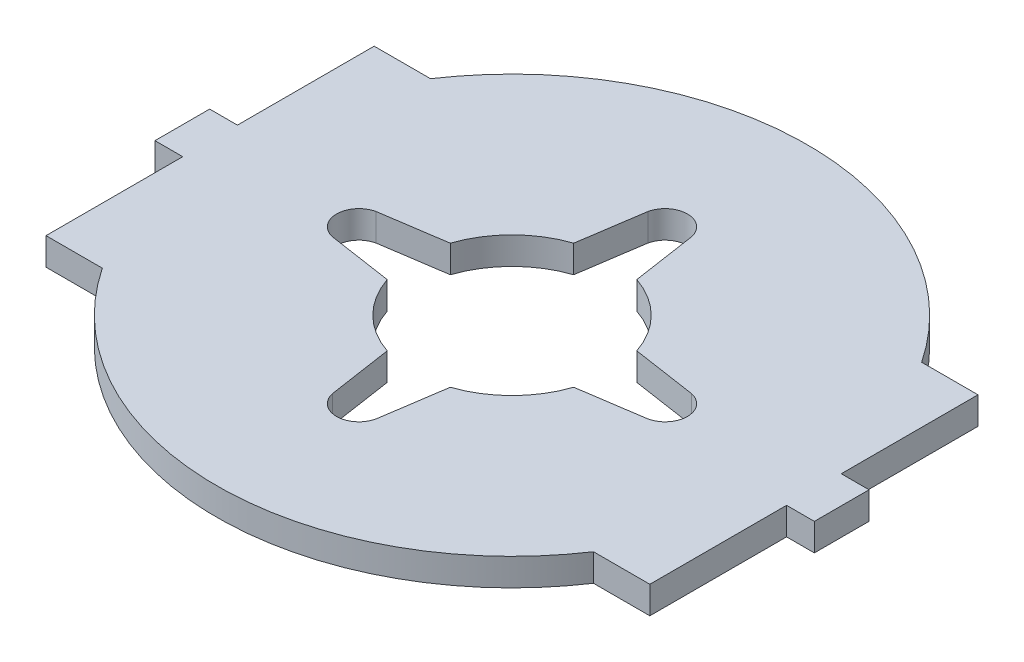
ISO-10303-21;
HEADER;
FILE_DESCRIPTION(('STEP AP214'),'2;1');
FILE_NAME('part.step','',(''),(''),'','','');
FILE_SCHEMA(('AUTOMOTIVE_DESIGN { 1 0 10303 214 1 1 1 1 }'));
ENDSEC;
DATA;
#1=APPLICATION_CONTEXT('core data for automotive mechanical design processes');
#2=APPLICATION_PROTOCOL_DEFINITION('international standard','automotive_design',2000,#1);
#3=PRODUCT_CONTEXT('',#1,'mechanical');
#4=PRODUCT('Part','Part','',(#3));
#5=PRODUCT_RELATED_PRODUCT_CATEGORY('part','',(#4));
#6=PRODUCT_DEFINITION_FORMATION('','',#4);
#7=PRODUCT_DEFINITION_CONTEXT('part definition',#1,'design');
#8=PRODUCT_DEFINITION('design','',#6,#7);
#9=PRODUCT_DEFINITION_SHAPE('','',#8);
#10=(LENGTH_UNIT() NAMED_UNIT(*) SI_UNIT(.MILLI.,.METRE.));
#11=(NAMED_UNIT(*) PLANE_ANGLE_UNIT() SI_UNIT($,.RADIAN.));
#12=(NAMED_UNIT(*) SI_UNIT($,.STERADIAN.) SOLID_ANGLE_UNIT());
#13=UNCERTAINTY_MEASURE_WITH_UNIT(LENGTH_MEASURE(1.E-05),#10,'distance_accuracy_value','');
#14=(GEOMETRIC_REPRESENTATION_CONTEXT(3) GLOBAL_UNCERTAINTY_ASSIGNED_CONTEXT((#13)) GLOBAL_UNIT_ASSIGNED_CONTEXT((#10,
#11,#12)) REPRESENTATION_CONTEXT('',''));
#15=CARTESIAN_POINT('',(0.,0.,0.));
#16=DIRECTION('',(0.,0.,1.));
#17=DIRECTION('',(1.,0.,0.));
#18=AXIS2_PLACEMENT_3D('',#15,#16,#17);
#19=CARTESIAN_POINT('',(35.052,3.175,19.05));
#20=DIRECTION('',(-1.,0.,0.));
#21=DIRECTION('',(0.,0.,1.));
#22=AXIS2_PLACEMENT_3D('',#19,#20,#21);
#23=PLANE('',#22);
#24=DIRECTION('',(0.,1.,0.));
#25=VECTOR('',#24,1.);
#26=CARTESIAN_POINT('',(35.052,0.,-3.175));
#27=LINE('',#26,#25);
#28=CARTESIAN_POINT('',(35.052,0.,-3.175));
#29=VERTEX_POINT('',#28);
#30=CARTESIAN_POINT('',(35.052,3.175,-3.175));
#31=VERTEX_POINT('',#30);
#32=EDGE_CURVE('E308',#29,#31,#27,.T.);
#33=ORIENTED_EDGE('',*,*,#32,.F.);
#34=DIRECTION('',(0.,0.,-1.));
#35=VECTOR('',#34,1.);
#36=CARTESIAN_POINT('',(35.052,0.,19.05));
#37=LINE('',#36,#35);
#38=CARTESIAN_POINT('',(35.052,0.,-19.05));
#39=VERTEX_POINT('',#38);
#40=EDGE_CURVE('E449',#29,#39,#37,.T.);
#41=ORIENTED_EDGE('',*,*,#40,.T.);
#42=DIRECTION('',(0.,-1.,0.));
#43=VECTOR('',#42,1.);
#44=CARTESIAN_POINT('',(35.052,3.175,-19.05));
#45=LINE('',#44,#43);
#46=CARTESIAN_POINT('',(35.052,3.175,-19.05));
#47=VERTEX_POINT('',#46);
#48=EDGE_CURVE('E325',#47,#39,#45,.T.);
#49=ORIENTED_EDGE('',*,*,#48,.F.);
#50=DIRECTION('',(0.,0.,-1.));
#51=VECTOR('',#50,1.);
#52=CARTESIAN_POINT('',(35.052,3.175,19.05));
#53=LINE('',#52,#51);
#54=EDGE_CURVE('E456',#31,#47,#53,.T.);
#55=ORIENTED_EDGE('',*,*,#54,.F.);
#56=EDGE_LOOP('',(#33,#41,#49,#55));
#57=FACE_BOUND('',#56,.T.);
#58=ADVANCED_FACE('F32',(#57),#23,.F.);
#59=CARTESIAN_POINT('',(-35.052,3.175,19.05));
#60=DIRECTION('',(1.,0.,0.));
#61=DIRECTION('',(0.,0.,-1.));
#62=AXIS2_PLACEMENT_3D('',#59,#60,#61);
#63=PLANE('',#62);
#64=DIRECTION('',(0.,1.,0.));
#65=VECTOR('',#64,1.);
#66=CARTESIAN_POINT('',(-35.052,0.,3.175));
#67=LINE('',#66,#65);
#68=CARTESIAN_POINT('',(-35.052,0.,3.175));
#69=VERTEX_POINT('',#68);
#70=CARTESIAN_POINT('',(-35.052,3.175,3.175));
#71=VERTEX_POINT('',#70);
#72=EDGE_CURVE('E416',#69,#71,#67,.T.);
#73=ORIENTED_EDGE('',*,*,#72,.F.);
#74=DIRECTION('',(0.,0.,1.));
#75=VECTOR('',#74,1.);
#76=CARTESIAN_POINT('',(-35.052,0.,19.05));
#77=LINE('',#76,#75);
#78=CARTESIAN_POINT('',(-35.052,0.,19.05));
#79=VERTEX_POINT('',#78);
#80=EDGE_CURVE('E475',#69,#79,#77,.T.);
#81=ORIENTED_EDGE('',*,*,#80,.T.);
#82=DIRECTION('',(0.,-1.,0.));
#83=VECTOR('',#82,1.);
#84=CARTESIAN_POINT('',(-35.052,3.175,19.05));
#85=LINE('',#84,#83);
#86=CARTESIAN_POINT('',(-35.052,3.175,19.05));
#87=VERTEX_POINT('',#86);
#88=EDGE_CURVE('E494',#87,#79,#85,.T.);
#89=ORIENTED_EDGE('',*,*,#88,.F.);
#90=DIRECTION('',(0.,0.,1.));
#91=VECTOR('',#90,1.);
#92=CARTESIAN_POINT('',(-35.052,3.175,19.05));
#93=LINE('',#92,#91);
#94=EDGE_CURVE('E509',#71,#87,#93,.T.);
#95=ORIENTED_EDGE('',*,*,#94,.F.);
#96=EDGE_LOOP('',(#73,#81,#89,#95));
#97=FACE_BOUND('',#96,.T.);
#98=ADVANCED_FACE('F548',(#97),#63,.F.);
#99=CARTESIAN_POINT('',(-35.052,3.175,-19.05));
#100=DIRECTION('',(0.,0.,1.));
#101=DIRECTION('',(1.,0.,0.));
#102=AXIS2_PLACEMENT_3D('',#99,#100,#101);
#103=PLANE('',#102);
#104=DIRECTION('',(-1.,0.,0.));
#105=VECTOR('',#104,1.);
#106=CARTESIAN_POINT('',(-35.052,0.,-19.05));
#107=LINE('',#106,#105);
#108=CARTESIAN_POINT('',(28.5114292872174,0.,-19.05));
#109=VERTEX_POINT('',#108);
#110=EDGE_CURVE('E471',#39,#109,#107,.T.);
#111=ORIENTED_EDGE('',*,*,#110,.T.);
#112=DIRECTION('',(0.,1.,0.));
#113=VECTOR('',#112,1.);
#114=CARTESIAN_POINT('',(28.5114292872174,0.,-19.05));
#115=LINE('',#114,#113);
#116=CARTESIAN_POINT('',(28.5114292872174,3.175,-19.05));
#117=VERTEX_POINT('',#116);
#118=EDGE_CURVE('E446',#109,#117,#115,.T.);
#119=ORIENTED_EDGE('',*,*,#118,.T.);
#120=DIRECTION('',(-1.,0.,0.));
#121=VECTOR('',#120,1.);
#122=CARTESIAN_POINT('',(-35.052,3.175,-19.05));
#123=LINE('',#122,#121);
#124=EDGE_CURVE('E452',#47,#117,#123,.T.);
#125=ORIENTED_EDGE('',*,*,#124,.F.);
#126=ORIENTED_EDGE('',*,*,#48,.T.);
#127=EDGE_LOOP('',(#111,#119,#125,#126));
#128=FACE_BOUND('',#127,.T.);
#129=ADVANCED_FACE('F553',(#128),#103,.F.);
#130=CARTESIAN_POINT('',(-35.052,3.175,19.05));
#131=DIRECTION('',(0.,0.,-1.));
#132=DIRECTION('',(-1.,0.,0.));
#133=AXIS2_PLACEMENT_3D('',#130,#131,#132);
#134=PLANE('',#133);
#135=DIRECTION('',(1.,0.,0.));
#136=VECTOR('',#135,1.);
#137=CARTESIAN_POINT('',(-35.052,0.,19.05));
#138=LINE('',#137,#136);
#139=CARTESIAN_POINT('',(-28.5114292872174,0.,19.05));
#140=VERTEX_POINT('',#139);
#141=EDGE_CURVE('E479',#79,#140,#138,.T.);
#142=ORIENTED_EDGE('',*,*,#141,.T.);
#143=DIRECTION('',(0.,1.,0.));
#144=VECTOR('',#143,1.);
#145=CARTESIAN_POINT('',(-28.5114292872174,0.,19.05));
#146=LINE('',#145,#144);
#147=CARTESIAN_POINT('',(-28.5114292872174,3.175,19.05));
#148=VERTEX_POINT('',#147);
#149=EDGE_CURVE('E440',#140,#148,#146,.T.);
#150=ORIENTED_EDGE('',*,*,#149,.T.);
#151=DIRECTION('',(1.,0.,0.));
#152=VECTOR('',#151,1.);
#153=CARTESIAN_POINT('',(-35.052,3.175,19.05));
#154=LINE('',#153,#152);
#155=EDGE_CURVE('E470',#87,#148,#154,.T.);
#156=ORIENTED_EDGE('',*,*,#155,.F.);
#157=ORIENTED_EDGE('',*,*,#88,.T.);
#158=EDGE_LOOP('',(#142,#150,#156,#157));
#159=FACE_BOUND('',#158,.T.);
#160=ADVANCED_FACE('F560',(#159),#134,.F.);
#161=CARTESIAN_POINT('',(35.052,0.,19.05));
#162=VERTEX_POINT('',#161);
#163=CARTESIAN_POINT('',(35.052,0.,3.175));
#164=VERTEX_POINT('',#163);
#165=EDGE_CURVE('E465',#162,#164,#37,.T.);
#166=ORIENTED_EDGE('',*,*,#165,.T.);
#167=DIRECTION('',(0.,1.,0.));
#168=VECTOR('',#167,1.);
#169=CARTESIAN_POINT('',(35.052,0.,3.175));
#170=LINE('',#169,#168);
#171=CARTESIAN_POINT('',(35.052,3.175,3.17500000000001));
#172=VERTEX_POINT('',#171);
#173=EDGE_CURVE('E315',#164,#172,#170,.T.);
#174=ORIENTED_EDGE('',*,*,#173,.T.);
#175=CARTESIAN_POINT('',(35.052,3.175,19.05));
#176=VERTEX_POINT('',#175);
#177=EDGE_CURVE('E459',#176,#172,#53,.T.);
#178=ORIENTED_EDGE('',*,*,#177,.F.);
#179=DIRECTION('',(0.,-1.,0.));
#180=VECTOR('',#179,1.);
#181=CARTESIAN_POINT('',(35.052,3.175,19.05));
#182=LINE('',#181,#180);
#183=EDGE_CURVE('E496',#176,#162,#182,.T.);
#184=ORIENTED_EDGE('',*,*,#183,.T.);
#185=EDGE_LOOP('',(#166,#174,#178,#184));
#186=FACE_BOUND('',#185,.T.);
#187=ADVANCED_FACE('F34',(#186),#23,.F.);
#188=CARTESIAN_POINT('',(-28.5114292872174,3.175,-19.05));
#189=VERTEX_POINT('',#188);
#190=CARTESIAN_POINT('',(-35.052,3.175,-19.05));
#191=VERTEX_POINT('',#190);
#192=EDGE_CURVE('E462',#189,#191,#123,.T.);
#193=ORIENTED_EDGE('',*,*,#192,.F.);
#194=DIRECTION('',(0.,1.,0.));
#195=VECTOR('',#194,1.);
#196=CARTESIAN_POINT('',(-28.5114292872174,0.,-19.05));
#197=LINE('',#196,#195);
#198=CARTESIAN_POINT('',(-28.5114292872174,0.,-19.05));
#199=VERTEX_POINT('',#198);
#200=EDGE_CURVE('E443',#189,#199,#197,.F.);
#201=ORIENTED_EDGE('',*,*,#200,.T.);
#202=CARTESIAN_POINT('',(-35.052,0.,-19.05));
#203=VERTEX_POINT('',#202);
#204=EDGE_CURVE('E476',#199,#203,#107,.T.);
#205=ORIENTED_EDGE('',*,*,#204,.T.);
#206=DIRECTION('',(0.,-1.,0.));
#207=VECTOR('',#206,1.);
#208=CARTESIAN_POINT('',(-35.052,3.175,-19.05));
#209=LINE('',#208,#207);
#210=EDGE_CURVE('E491',#191,#203,#209,.T.);
#211=ORIENTED_EDGE('',*,*,#210,.F.);
#212=EDGE_LOOP('',(#193,#201,#205,#211));
#213=FACE_BOUND('',#212,.T.);
#214=ADVANCED_FACE('F559',(#213),#103,.F.);
#215=CARTESIAN_POINT('',(-35.052,0.,-3.175));
#216=VERTEX_POINT('',#215);
#217=EDGE_CURVE('E485',#203,#216,#77,.T.);
#218=ORIENTED_EDGE('',*,*,#217,.T.);
#219=DIRECTION('',(0.,1.,0.));
#220=VECTOR('',#219,1.);
#221=CARTESIAN_POINT('',(-35.052,0.,-3.175));
#222=LINE('',#221,#220);
#223=CARTESIAN_POINT('',(-35.052,3.175,-3.17499999999999));
#224=VERTEX_POINT('',#223);
#225=EDGE_CURVE('E520',#216,#224,#222,.T.);
#226=ORIENTED_EDGE('',*,*,#225,.T.);
#227=EDGE_CURVE('E506',#191,#224,#93,.T.);
#228=ORIENTED_EDGE('',*,*,#227,.F.);
#229=ORIENTED_EDGE('',*,*,#210,.T.);
#230=EDGE_LOOP('',(#218,#226,#228,#229));
#231=FACE_BOUND('',#230,.T.);
#232=ADVANCED_FACE('F556',(#231),#63,.F.);
#233=CARTESIAN_POINT('',(28.5114292872174,3.175,19.05));
#234=VERTEX_POINT('',#233);
#235=EDGE_CURVE('E504',#234,#176,#154,.T.);
#236=ORIENTED_EDGE('',*,*,#235,.F.);
#237=DIRECTION('',(0.,1.,0.));
#238=VECTOR('',#237,1.);
#239=CARTESIAN_POINT('',(28.5114292872174,0.,19.05));
#240=LINE('',#239,#238);
#241=CARTESIAN_POINT('',(28.5114292872174,0.,19.05));
#242=VERTEX_POINT('',#241);
#243=EDGE_CURVE('E437',#234,#242,#240,.F.);
#244=ORIENTED_EDGE('',*,*,#243,.T.);
#245=EDGE_CURVE('E488',#242,#162,#138,.T.);
#246=ORIENTED_EDGE('',*,*,#245,.T.);
#247=ORIENTED_EDGE('',*,*,#183,.F.);
#248=EDGE_LOOP('',(#236,#244,#246,#247));
#249=FACE_BOUND('',#248,.T.);
#250=ADVANCED_FACE('F568',(#249),#134,.F.);
#251=CARTESIAN_POINT('',(35.052,3.175,-19.05));
#252=DIRECTION('',(0.,-1.,0.));
#253=DIRECTION('',(0.,0.,-1.));
#254=AXIS2_PLACEMENT_3D('',#251,#252,#253);
#255=PLANE('',#254);
#256=DIRECTION('',(-0.148134237309503,0.,-0.988967263228026));
#257=VECTOR('',#256,1.);
#258=CARTESIAN_POINT('',(2.54,3.175,-18.3060770000733));
#259=LINE('',#258,#257);
#260=CARTESIAN_POINT('',(3.66009636812809,3.175,-10.8281390172095));
#261=VERTEX_POINT('',#260);
#262=CARTESIAN_POINT('',(2.54,3.175,-18.3060770000733));
#263=VERTEX_POINT('',#262);
#264=EDGE_CURVE('E409',#261,#263,#259,.T.);
#265=ORIENTED_EDGE('',*,*,#264,.F.);
#266=CARTESIAN_POINT('',(0.,3.175,0.));
#267=DIRECTION('',(0.,1.,0.));
#268=DIRECTION('',(0.,0.,1.));
#269=AXIS2_PLACEMENT_3D('',#266,#267,#268);
#270=CIRCLE('',#269,11.43);
#271=CARTESIAN_POINT('',(10.8281390172095,3.175,-3.6600963681282));
#272=VERTEX_POINT('',#271);
#273=EDGE_CURVE('E261',#272,#261,#270,.T.);
#274=ORIENTED_EDGE('',*,*,#273,.F.);
#275=DIRECTION('',(-0.988967263228028,0.,-0.148134237309493));
#276=VECTOR('',#275,1.);
#277=CARTESIAN_POINT('',(18.3060770000732,3.175,-2.54000000000019));
#278=LINE('',#277,#276);
#279=CARTESIAN_POINT('',(18.3060770000732,3.175,-2.54000000000019));
#280=VERTEX_POINT('',#279);
#281=EDGE_CURVE('E383',#280,#272,#278,.T.);
#282=ORIENTED_EDGE('',*,*,#281,.F.);
#283=CARTESIAN_POINT('',(17.7701158247429,3.175,-1.86132083373512E-13));
#284=DIRECTION('',(0.,1.,0.));
#285=DIRECTION('',(1.,0.,0.));
#286=AXIS2_PLACEMENT_3D('',#283,#284,#285);
#287=CIRCLE('',#286,2.59593034988644);
#288=CARTESIAN_POINT('',(18.3060770000733,3.175,2.53999999999981));
#289=VERTEX_POINT('',#288);
#290=EDGE_CURVE('E380',#289,#280,#287,.T.);
#291=ORIENTED_EDGE('',*,*,#290,.F.);
#292=DIRECTION('',(0.988967263228025,0.,-0.148134237309514));
#293=VECTOR('',#292,1.);
#294=CARTESIAN_POINT('',(18.3060770000733,3.175,2.53999999999981));
#295=LINE('',#294,#293);
#296=CARTESIAN_POINT('',(10.8281390172096,3.175,3.66009636812797));
#297=VERTEX_POINT('',#296);
#298=EDGE_CURVE('E260',#297,#289,#295,.T.);
#299=ORIENTED_EDGE('',*,*,#298,.F.);
#300=CARTESIAN_POINT('',(3.66009636812809,3.175,10.8281390172095));
#301=VERTEX_POINT('',#300);
#302=EDGE_CURVE('E243',#301,#297,#270,.T.);
#303=ORIENTED_EDGE('',*,*,#302,.F.);
#304=DIRECTION('',(0.148134237309503,0.,-0.988967263228026));
#305=VECTOR('',#304,1.);
#306=CARTESIAN_POINT('',(2.54,3.175,18.3060770000733));
#307=LINE('',#306,#305);
#308=CARTESIAN_POINT('',(2.54,3.175,18.3060770000733));
#309=VERTEX_POINT('',#308);
#310=EDGE_CURVE('E258',#309,#301,#307,.T.);
#311=ORIENTED_EDGE('',*,*,#310,.F.);
#312=CARTESIAN_POINT('',(0.,3.175,17.7701158247429));
#313=DIRECTION('',(0.,1.,0.));
#314=DIRECTION('',(0.,0.,1.));
#315=AXIS2_PLACEMENT_3D('',#312,#313,#314);
#316=CIRCLE('',#315,2.59593034988644);
#317=CARTESIAN_POINT('',(-2.54,3.175,18.3060770000733));
#318=VERTEX_POINT('',#317);
#319=EDGE_CURVE('E268',#318,#309,#316,.T.);
#320=ORIENTED_EDGE('',*,*,#319,.F.);
#321=DIRECTION('',(0.148134237309503,0.,0.988967263228026));
#322=VECTOR('',#321,1.);
#323=CARTESIAN_POINT('',(-2.54,3.175,18.3060770000733));
#324=LINE('',#323,#322);
#325=CARTESIAN_POINT('',(-3.66009636812809,3.175,10.8281390172095));
#326=VERTEX_POINT('',#325);
#327=EDGE_CURVE('E272',#326,#318,#324,.T.);
#328=ORIENTED_EDGE('',*,*,#327,.F.);
#329=CARTESIAN_POINT('',(-10.8281390172095,3.175,3.66009636812812));
#330=VERTEX_POINT('',#329);
#331=EDGE_CURVE('E55',#330,#326,#270,.T.);
#332=ORIENTED_EDGE('',*,*,#331,.F.);
#333=DIRECTION('',(0.988967263228027,0.,0.1481342373095));
#334=VECTOR('',#333,1.);
#335=CARTESIAN_POINT('',(-18.3060770000733,3.175,2.54000000000006));
#336=LINE('',#335,#334);
#337=CARTESIAN_POINT('',(-18.3060770000733,3.175,2.54000000000006));
#338=VERTEX_POINT('',#337);
#339=EDGE_CURVE('E282',#338,#330,#336,.T.);
#340=ORIENTED_EDGE('',*,*,#339,.F.);
#341=CARTESIAN_POINT('',(-17.7701158247429,3.175,0.));
#342=DIRECTION('',(0.,1.,0.));
#343=DIRECTION('',(-1.,0.,0.));
#344=AXIS2_PLACEMENT_3D('',#341,#342,#343);
#345=CIRCLE('',#344,2.59593034988644);
#346=CARTESIAN_POINT('',(-18.3060770000733,3.175,-2.53999999999994));
#347=VERTEX_POINT('',#346);
#348=EDGE_CURVE('E279',#347,#338,#345,.T.);
#349=ORIENTED_EDGE('',*,*,#348,.F.);
#350=DIRECTION('',(-0.988967263228026,0.,0.148134237309507));
#351=VECTOR('',#350,1.);
#352=CARTESIAN_POINT('',(-18.3060770000733,3.175,-2.53999999999994));
#353=LINE('',#352,#351);
#354=CARTESIAN_POINT('',(-10.8281390172095,3.175,-3.66009636812805));
#355=VERTEX_POINT('',#354);
#356=EDGE_CURVE('E276',#355,#347,#353,.T.);
#357=ORIENTED_EDGE('',*,*,#356,.F.);
#358=CARTESIAN_POINT('',(-3.66009636812809,3.175,-10.8281390172095));
#359=VERTEX_POINT('',#358);
#360=EDGE_CURVE('E47',#359,#355,#270,.T.);
#361=ORIENTED_EDGE('',*,*,#360,.F.);
#362=DIRECTION('',(-0.148134237309503,0.,0.988967263228026));
#363=VECTOR('',#362,1.);
#364=CARTESIAN_POINT('',(-2.54,3.175,-18.3060770000733));
#365=LINE('',#364,#363);
#366=CARTESIAN_POINT('',(-2.54,3.175,-18.3060770000733));
#367=VERTEX_POINT('',#366);
#368=EDGE_CURVE('E418',#367,#359,#365,.T.);
#369=ORIENTED_EDGE('',*,*,#368,.F.);
#370=CARTESIAN_POINT('',(0.,3.175,-17.7701158247429));
#371=DIRECTION('',(0.,1.,0.));
#372=DIRECTION('',(0.,0.,-1.));
#373=AXIS2_PLACEMENT_3D('',#370,#371,#372);
#374=CIRCLE('',#373,2.59593034988644);
#375=EDGE_CURVE('E415',#263,#367,#374,.T.);
#376=ORIENTED_EDGE('',*,*,#375,.F.);
#377=EDGE_LOOP('',(#265,#274,#282,#291,#299,#303,#311,#320,#328,#332,#340,#349,#357,#361,#369,#376));
#378=FACE_BOUND('',#377,.T.);
#379=ORIENTED_EDGE('',*,*,#155,.T.);
#380=CARTESIAN_POINT('',(0.,3.175,0.));
#381=DIRECTION('',(0.,1.,0.));
#382=DIRECTION('',(0.,0.,1.));
#383=AXIS2_PLACEMENT_3D('',#380,#381,#382);
#384=CIRCLE('',#383,34.29);
#385=EDGE_CURVE('E429',#148,#234,#384,.T.);
#386=ORIENTED_EDGE('',*,*,#385,.T.);
#387=ORIENTED_EDGE('',*,*,#235,.T.);
#388=ORIENTED_EDGE('',*,*,#177,.T.);
#389=DIRECTION('',(-1.,0.,0.));
#390=VECTOR('',#389,1.);
#391=CARTESIAN_POINT('',(38.2778,3.175,3.175));
#392=LINE('',#391,#390);
#393=CARTESIAN_POINT('',(38.2778,3.175,3.175));
#394=VERTEX_POINT('',#393);
#395=EDGE_CURVE('E295',#394,#172,#392,.T.);
#396=ORIENTED_EDGE('',*,*,#395,.F.);
#397=DIRECTION('',(0.,0.,1.));
#398=VECTOR('',#397,1.);
#399=CARTESIAN_POINT('',(38.2778,3.175,-3.175));
#400=LINE('',#399,#398);
#401=CARTESIAN_POINT('',(38.2778,3.175,-3.175));
#402=VERTEX_POINT('',#401);
#403=EDGE_CURVE('E300',#402,#394,#400,.T.);
#404=ORIENTED_EDGE('',*,*,#403,.F.);
#405=DIRECTION('',(1.,0.,0.));
#406=VECTOR('',#405,1.);
#407=CARTESIAN_POINT('',(35.052,3.175,-3.175));
#408=LINE('',#407,#406);
#409=EDGE_CURVE('E302',#31,#402,#408,.T.);
#410=ORIENTED_EDGE('',*,*,#409,.F.);
#411=ORIENTED_EDGE('',*,*,#54,.T.);
#412=ORIENTED_EDGE('',*,*,#124,.T.);
#413=EDGE_CURVE('E435',#117,#189,#384,.T.);
#414=ORIENTED_EDGE('',*,*,#413,.T.);
#415=ORIENTED_EDGE('',*,*,#192,.T.);
#416=ORIENTED_EDGE('',*,*,#227,.T.);
#417=DIRECTION('',(-1.,0.,0.));
#418=VECTOR('',#417,1.);
#419=CARTESIAN_POINT('',(-35.052,3.175,-3.175));
#420=LINE('',#419,#418);
#421=CARTESIAN_POINT('',(-38.2778,3.175,-3.175));
#422=VERTEX_POINT('',#421);
#423=EDGE_CURVE('E311',#224,#422,#420,.T.);
#424=ORIENTED_EDGE('',*,*,#423,.T.);
#425=DIRECTION('',(0.,0.,1.));
#426=VECTOR('',#425,1.);
#427=CARTESIAN_POINT('',(-38.2778,3.175,-3.175));
#428=LINE('',#427,#426);
#429=CARTESIAN_POINT('',(-38.2778,3.175,3.175));
#430=VERTEX_POINT('',#429);
#431=EDGE_CURVE('E517',#422,#430,#428,.T.);
#432=ORIENTED_EDGE('',*,*,#431,.T.);
#433=DIRECTION('',(1.,0.,0.));
#434=VECTOR('',#433,1.);
#435=CARTESIAN_POINT('',(-38.2778,3.175,3.175));
#436=LINE('',#435,#434);
#437=EDGE_CURVE('E586',#430,#71,#436,.T.);
#438=ORIENTED_EDGE('',*,*,#437,.T.);
#439=ORIENTED_EDGE('',*,*,#94,.T.);
#440=EDGE_LOOP('',(#379,#386,#387,#388,#396,#404,#410,#411,#412,#414,#415,#416,#424,#432,#438,#439));
#441=FACE_BOUND('',#440,.T.);
#442=ADVANCED_FACE('F255',(#378,#441),#255,.F.);
#443=CARTESIAN_POINT('',(35.052,0.,-19.05));
#444=DIRECTION('',(0.,-1.,0.));
#445=DIRECTION('',(0.,0.,-1.));
#446=AXIS2_PLACEMENT_3D('',#443,#444,#445);
#447=PLANE('',#446);
#448=CARTESIAN_POINT('',(0.,0.,0.));
#449=DIRECTION('',(0.,-1.,0.));
#450=DIRECTION('',(0.,0.,-1.));
#451=AXIS2_PLACEMENT_3D('',#448,#449,#450);
#452=CIRCLE('',#451,11.43);
#453=CARTESIAN_POINT('',(3.66009636812809,0.,-10.8281390172095));
#454=VERTEX_POINT('',#453);
#455=CARTESIAN_POINT('',(10.8281390172095,0.,-3.6600963681282));
#456=VERTEX_POINT('',#455);
#457=EDGE_CURVE('E365',#454,#456,#452,.T.);
#458=ORIENTED_EDGE('',*,*,#457,.F.);
#459=DIRECTION('',(-0.148134237309503,0.,-0.988967263228026));
#460=VECTOR('',#459,1.);
#461=CARTESIAN_POINT('',(2.54,0.,-18.3060770000733));
#462=LINE('',#461,#460);
#463=CARTESIAN_POINT('',(2.54,0.,-18.3060770000733));
#464=VERTEX_POINT('',#463);
#465=EDGE_CURVE('E411',#454,#464,#462,.T.);
#466=ORIENTED_EDGE('',*,*,#465,.T.);
#467=CARTESIAN_POINT('',(0.,0.,-17.7701158247429));
#468=DIRECTION('',(0.,1.,0.));
#469=DIRECTION('',(0.,0.,-1.));
#470=AXIS2_PLACEMENT_3D('',#467,#468,#469);
#471=CIRCLE('',#470,2.59593034988644);
#472=CARTESIAN_POINT('',(-2.54,0.,-18.3060770000733));
#473=VERTEX_POINT('',#472);
#474=EDGE_CURVE('E532',#464,#473,#471,.T.);
#475=ORIENTED_EDGE('',*,*,#474,.T.);
#476=DIRECTION('',(-0.148134237309503,0.,0.988967263228026));
#477=VECTOR('',#476,1.);
#478=CARTESIAN_POINT('',(-2.54,0.,-18.3060770000733));
#479=LINE('',#478,#477);
#480=CARTESIAN_POINT('',(-3.66009636812809,0.,-10.8281390172095));
#481=VERTEX_POINT('',#480);
#482=EDGE_CURVE('E355',#473,#481,#479,.T.);
#483=ORIENTED_EDGE('',*,*,#482,.T.);
#484=CARTESIAN_POINT('',(-10.8281390172096,0.,-3.66009636812805));
#485=VERTEX_POINT('',#484);
#486=EDGE_CURVE('E352',#485,#481,#452,.T.);
#487=ORIENTED_EDGE('',*,*,#486,.F.);
#488=DIRECTION('',(0.988967263228026,0.,-0.148134237309507));
#489=VECTOR('',#488,1.);
#490=CARTESIAN_POINT('',(36.2998371120074,0.,-10.7192448955071));
#491=LINE('',#490,#489);
#492=CARTESIAN_POINT('',(-18.3060770000733,0.,-2.53999999999994));
#493=VERTEX_POINT('',#492);
#494=EDGE_CURVE('E292',#493,#485,#491,.T.);
#495=ORIENTED_EDGE('',*,*,#494,.F.);
#496=CARTESIAN_POINT('',(-17.7701158247429,0.,0.));
#497=DIRECTION('',(0.,-1.,0.));
#498=DIRECTION('',(0.,0.,-1.));
#499=AXIS2_PLACEMENT_3D('',#496,#497,#498);
#500=CIRCLE('',#499,2.59593034988644);
#501=CARTESIAN_POINT('',(-18.3060770000733,0.,2.54000000000006));
#502=VERTEX_POINT('',#501);
#503=EDGE_CURVE('E40',#502,#493,#500,.T.);
#504=ORIENTED_EDGE('',*,*,#503,.F.);
#505=DIRECTION('',(-0.988967263228027,0.,-0.1481342373095));
#506=VECTOR('',#505,1.);
#507=CARTESIAN_POINT('',(30.718190492912,0.,9.88318793427633));
#508=LINE('',#507,#506);
#509=CARTESIAN_POINT('',(-10.8281390172095,0.,3.66009636812812));
#510=VERTEX_POINT('',#509);
#511=EDGE_CURVE('E334',#510,#502,#508,.T.);
#512=ORIENTED_EDGE('',*,*,#511,.F.);
#513=CARTESIAN_POINT('',(-3.66009636812809,0.,10.8281390172095));
#514=VERTEX_POINT('',#513);
#515=EDGE_CURVE('E360',#514,#510,#452,.T.);
#516=ORIENTED_EDGE('',*,*,#515,.F.);
#517=DIRECTION('',(-0.148134237309503,0.,-0.988967263228026));
#518=VECTOR('',#517,1.);
#519=CARTESIAN_POINT('',(-7.18775243053948,0.,-12.7230428366085));
#520=LINE('',#519,#518);
#521=CARTESIAN_POINT('',(-2.54,0.,18.3060770000733));
#522=VERTEX_POINT('',#521);
#523=EDGE_CURVE('E331',#522,#514,#520,.T.);
#524=ORIENTED_EDGE('',*,*,#523,.F.);
#525=CARTESIAN_POINT('',(0.,0.,17.7701158247429));
#526=DIRECTION('',(0.,-1.,0.));
#527=DIRECTION('',(0.,0.,-1.));
#528=AXIS2_PLACEMENT_3D('',#525,#526,#527);
#529=CIRCLE('',#528,2.59593034988644);
#530=CARTESIAN_POINT('',(2.54,0.,18.3060770000733));
#531=VERTEX_POINT('',#530);
#532=EDGE_CURVE('E329',#531,#522,#529,.T.);
#533=ORIENTED_EDGE('',*,*,#532,.F.);
#534=DIRECTION('',(-0.148134237309503,0.,0.988967263228026));
#535=VECTOR('',#534,1.);
#536=CARTESIAN_POINT('',(8.72609723920364,0.,-22.9932726157444));
#537=LINE('',#536,#535);
#538=CARTESIAN_POINT('',(3.66009636812808,0.,10.8281390172095));
#539=VERTEX_POINT('',#538);
#540=EDGE_CURVE('E327',#539,#531,#537,.T.);
#541=ORIENTED_EDGE('',*,*,#540,.F.);
#542=CARTESIAN_POINT('',(10.8281390172096,0.,3.66009636812797));
#543=VERTEX_POINT('',#542);
#544=EDGE_CURVE('E245',#543,#539,#452,.T.);
#545=ORIENTED_EDGE('',*,*,#544,.F.);
#546=DIRECTION('',(-0.988967263228025,0.,0.148134237309514));
#547=VECTOR('',#546,1.);
#548=CARTESIAN_POINT('',(37.8474646984241,0.,-0.387041844859794));
#549=LINE('',#548,#547);
#550=CARTESIAN_POINT('',(18.3060770000733,0.,2.53999999999981));
#551=VERTEX_POINT('',#550);
#552=EDGE_CURVE('E321',#551,#543,#549,.T.);
#553=ORIENTED_EDGE('',*,*,#552,.F.);
#554=CARTESIAN_POINT('',(17.7701158247429,0.,-1.86132083373512E-13));
#555=DIRECTION('',(0.,-1.,0.));
#556=DIRECTION('',(0.,0.,-1.));
#557=AXIS2_PLACEMENT_3D('',#554,#555,#556);
#558=CIRCLE('',#557,2.59593034988644);
#559=CARTESIAN_POINT('',(18.3060770000732,0.,-2.54000000000019));
#560=VERTEX_POINT('',#559);
#561=EDGE_CURVE('E324',#560,#551,#558,.T.);
#562=ORIENTED_EDGE('',*,*,#561,.F.);
#563=DIRECTION('',(0.988967263228028,0.,0.148134237309493));
#564=VECTOR('',#563,1.);
#565=CARTESIAN_POINT('',(32.2658180793287,0.,-0.449015116371441));
#566=LINE('',#565,#564);
#567=EDGE_CURVE('E288',#456,#560,#566,.T.);
#568=ORIENTED_EDGE('',*,*,#567,.F.);
#569=EDGE_LOOP('',(#458,#466,#475,#483,#487,#495,#504,#512,#516,#524,#533,#541,#545,#553,#562,#568));
#570=FACE_BOUND('',#569,.T.);
#571=ORIENTED_EDGE('',*,*,#204,.F.);
#572=CARTESIAN_POINT('',(0.,0.,0.));
#573=DIRECTION('',(0.,1.,0.));
#574=DIRECTION('',(0.,0.,1.));
#575=AXIS2_PLACEMENT_3D('',#572,#573,#574);
#576=CIRCLE('',#575,34.29);
#577=EDGE_CURVE('E434',#109,#199,#576,.T.);
#578=ORIENTED_EDGE('',*,*,#577,.F.);
#579=ORIENTED_EDGE('',*,*,#110,.F.);
#580=ORIENTED_EDGE('',*,*,#40,.F.);
#581=DIRECTION('',(1.,0.,0.));
#582=VECTOR('',#581,1.);
#583=CARTESIAN_POINT('',(35.052,0.,-3.175));
#584=LINE('',#583,#582);
#585=CARTESIAN_POINT('',(38.2778,0.,-3.175));
#586=VERTEX_POINT('',#585);
#587=EDGE_CURVE('E298',#29,#586,#584,.T.);
#588=ORIENTED_EDGE('',*,*,#587,.T.);
#589=DIRECTION('',(0.,0.,1.));
#590=VECTOR('',#589,1.);
#591=CARTESIAN_POINT('',(38.2778,0.,-3.175));
#592=LINE('',#591,#590);
#593=CARTESIAN_POINT('',(38.2778,0.,3.175));
#594=VERTEX_POINT('',#593);
#595=EDGE_CURVE('E296',#586,#594,#592,.T.);
#596=ORIENTED_EDGE('',*,*,#595,.T.);
#597=DIRECTION('',(-1.,0.,0.));
#598=VECTOR('',#597,1.);
#599=CARTESIAN_POINT('',(38.2778,0.,3.175));
#600=LINE('',#599,#598);
#601=EDGE_CURVE('E299',#594,#164,#600,.T.);
#602=ORIENTED_EDGE('',*,*,#601,.T.);
#603=ORIENTED_EDGE('',*,*,#165,.F.);
#604=ORIENTED_EDGE('',*,*,#245,.F.);
#605=EDGE_CURVE('E432',#140,#242,#576,.T.);
#606=ORIENTED_EDGE('',*,*,#605,.F.);
#607=ORIENTED_EDGE('',*,*,#141,.F.);
#608=ORIENTED_EDGE('',*,*,#80,.F.);
#609=DIRECTION('',(1.,0.,0.));
#610=VECTOR('',#609,1.);
#611=CARTESIAN_POINT('',(-38.2778,0.,3.175));
#612=LINE('',#611,#610);
#613=CARTESIAN_POINT('',(-38.2778,0.,3.175));
#614=VERTEX_POINT('',#613);
#615=EDGE_CURVE('E525',#614,#69,#612,.T.);
#616=ORIENTED_EDGE('',*,*,#615,.F.);
#617=DIRECTION('',(0.,0.,1.));
#618=VECTOR('',#617,1.);
#619=CARTESIAN_POINT('',(-38.2778,0.,-3.175));
#620=LINE('',#619,#618);
#621=CARTESIAN_POINT('',(-38.2778,0.,-3.175));
#622=VERTEX_POINT('',#621);
#623=EDGE_CURVE('E584',#622,#614,#620,.T.);
#624=ORIENTED_EDGE('',*,*,#623,.F.);
#625=DIRECTION('',(-1.,0.,0.));
#626=VECTOR('',#625,1.);
#627=CARTESIAN_POINT('',(-35.052,0.,-3.175));
#628=LINE('',#627,#626);
#629=EDGE_CURVE('E526',#216,#622,#628,.T.);
#630=ORIENTED_EDGE('',*,*,#629,.F.);
#631=ORIENTED_EDGE('',*,*,#217,.F.);
#632=EDGE_LOOP('',(#571,#578,#579,#580,#588,#596,#602,#603,#604,#606,#607,#608,#616,#624,#630,#631));
#633=FACE_BOUND('',#632,.T.);
#634=ADVANCED_FACE('F349',(#570,#633),#447,.T.);
#635=CARTESIAN_POINT('',(0.,0.,0.));
#636=DIRECTION('',(0.,1.,0.));
#637=DIRECTION('',(0.,0.,1.));
#638=AXIS2_PLACEMENT_3D('',#635,#636,#637);
#639=CYLINDRICAL_SURFACE('',#638,34.29);
#640=ORIENTED_EDGE('',*,*,#149,.F.);
#641=ORIENTED_EDGE('',*,*,#605,.T.);
#642=ORIENTED_EDGE('',*,*,#243,.F.);
#643=ORIENTED_EDGE('',*,*,#385,.F.);
#644=EDGE_LOOP('',(#640,#641,#642,#643));
#645=FACE_BOUND('',#644,.T.);
#646=ADVANCED_FACE('F611',(#645),#639,.T.);
#647=ORIENTED_EDGE('',*,*,#118,.F.);
#648=ORIENTED_EDGE('',*,*,#577,.T.);
#649=ORIENTED_EDGE('',*,*,#200,.F.);
#650=ORIENTED_EDGE('',*,*,#413,.F.);
#651=EDGE_LOOP('',(#647,#648,#649,#650));
#652=FACE_BOUND('',#651,.T.);
#653=ADVANCED_FACE('F615',(#652),#639,.T.);
#654=CARTESIAN_POINT('',(-2.54,0.,-18.3060770000733));
#655=DIRECTION('',(-0.988967263228026,0.,-0.148134237309503));
#656=DIRECTION('',(-0.148134237309503,0.,0.988967263228026));
#657=AXIS2_PLACEMENT_3D('',#654,#655,#656);
#658=PLANE('',#657);
#659=ORIENTED_EDGE('',*,*,#368,.T.);
#660=DIRECTION('',(0.,1.,0.));
#661=VECTOR('',#660,1.);
#662=CARTESIAN_POINT('',(-3.66009636812809,-5.00000000001367E-05,-10.8281390172095));
#663=LINE('',#662,#661);
#664=EDGE_CURVE('E357',#359,#481,#663,.F.);
#665=ORIENTED_EDGE('',*,*,#664,.T.);
#666=ORIENTED_EDGE('',*,*,#482,.F.);
#667=DIRECTION('',(0.,1.,0.));
#668=VECTOR('',#667,1.);
#669=CARTESIAN_POINT('',(-2.54,0.,-18.3060770000733));
#670=LINE('',#669,#668);
#671=EDGE_CURVE('E427',#473,#367,#670,.T.);
#672=ORIENTED_EDGE('',*,*,#671,.T.);
#673=EDGE_LOOP('',(#659,#665,#666,#672));
#674=FACE_BOUND('',#673,.T.);
#675=ADVANCED_FACE('F537',(#674),#658,.F.);
#676=CARTESIAN_POINT('',(0.,0.,-17.7701158247429));
#677=DIRECTION('',(0.,1.,0.));
#678=DIRECTION('',(0.,0.,1.));
#679=AXIS2_PLACEMENT_3D('',#676,#677,#678);
#680=CYLINDRICAL_SURFACE('',#679,2.59593034988644);
#681=ORIENTED_EDGE('',*,*,#375,.T.);
#682=ORIENTED_EDGE('',*,*,#671,.F.);
#683=ORIENTED_EDGE('',*,*,#474,.F.);
#684=DIRECTION('',(0.,1.,0.));
#685=VECTOR('',#684,1.);
#686=CARTESIAN_POINT('',(2.54,0.,-18.3060770000733));
#687=LINE('',#686,#685);
#688=EDGE_CURVE('E430',#464,#263,#687,.T.);
#689=ORIENTED_EDGE('',*,*,#688,.T.);
#690=EDGE_LOOP('',(#681,#682,#683,#689));
#691=FACE_BOUND('',#690,.T.);
#692=ADVANCED_FACE('F535',(#691),#680,.F.);
#693=CARTESIAN_POINT('',(2.54,0.,-18.3060770000733));
#694=DIRECTION('',(0.988967263228026,0.,-0.148134237309503));
#695=DIRECTION('',(-0.148134237309503,0.,-0.988967263228026));
#696=AXIS2_PLACEMENT_3D('',#693,#694,#695);
#697=PLANE('',#696);
#698=ORIENTED_EDGE('',*,*,#465,.F.);
#699=DIRECTION('',(0.,1.,0.));
#700=VECTOR('',#699,1.);
#701=CARTESIAN_POINT('',(3.66009636812809,-5.00000000001367E-05,-10.8281390172095));
#702=LINE('',#701,#700);
#703=EDGE_CURVE('E366',#454,#261,#702,.T.);
#704=ORIENTED_EDGE('',*,*,#703,.T.);
#705=ORIENTED_EDGE('',*,*,#264,.T.);
#706=ORIENTED_EDGE('',*,*,#688,.F.);
#707=EDGE_LOOP('',(#698,#704,#705,#706));
#708=FACE_BOUND('',#707,.T.);
#709=ADVANCED_FACE('F407',(#708),#697,.F.);
#710=CARTESIAN_POINT('',(-38.2778,0.,3.175));
#711=DIRECTION('',(0.,0.,1.));
#712=DIRECTION('',(1.,0.,0.));
#713=AXIS2_PLACEMENT_3D('',#710,#711,#712);
#714=PLANE('',#713);
#715=ORIENTED_EDGE('',*,*,#437,.F.);
#716=DIRECTION('',(0.,1.,0.));
#717=VECTOR('',#716,1.);
#718=CARTESIAN_POINT('',(-38.2778,0.,3.175));
#719=LINE('',#718,#717);
#720=EDGE_CURVE('E420',#614,#430,#719,.T.);
#721=ORIENTED_EDGE('',*,*,#720,.F.);
#722=ORIENTED_EDGE('',*,*,#615,.T.);
#723=ORIENTED_EDGE('',*,*,#72,.T.);
#724=EDGE_LOOP('',(#715,#721,#722,#723));
#725=FACE_BOUND('',#724,.T.);
#726=ADVANCED_FACE('F706',(#725),#714,.T.);
#727=CARTESIAN_POINT('',(-38.2778,0.,-3.175));
#728=DIRECTION('',(-1.,0.,0.));
#729=DIRECTION('',(0.,0.,1.));
#730=AXIS2_PLACEMENT_3D('',#727,#728,#729);
#731=PLANE('',#730);
#732=ORIENTED_EDGE('',*,*,#431,.F.);
#733=DIRECTION('',(0.,1.,0.));
#734=VECTOR('',#733,1.);
#735=CARTESIAN_POINT('',(-38.2778,0.,-3.175));
#736=LINE('',#735,#734);
#737=EDGE_CURVE('E524',#622,#422,#736,.T.);
#738=ORIENTED_EDGE('',*,*,#737,.F.);
#739=ORIENTED_EDGE('',*,*,#623,.T.);
#740=ORIENTED_EDGE('',*,*,#720,.T.);
#741=EDGE_LOOP('',(#732,#738,#739,#740));
#742=FACE_BOUND('',#741,.T.);
#743=ADVANCED_FACE('F604',(#742),#731,.T.);
#744=CARTESIAN_POINT('',(-35.052,0.,-3.175));
#745=DIRECTION('',(0.,0.,-1.));
#746=DIRECTION('',(-1.,0.,0.));
#747=AXIS2_PLACEMENT_3D('',#744,#745,#746);
#748=PLANE('',#747);
#749=ORIENTED_EDGE('',*,*,#423,.F.);
#750=ORIENTED_EDGE('',*,*,#225,.F.);
#751=ORIENTED_EDGE('',*,*,#629,.T.);
#752=ORIENTED_EDGE('',*,*,#737,.T.);
#753=EDGE_LOOP('',(#749,#750,#751,#752));
#754=FACE_BOUND('',#753,.T.);
#755=ADVANCED_FACE('F603',(#754),#748,.T.);
#756=CARTESIAN_POINT('',(35.052,0.,-3.175));
#757=DIRECTION('',(0.,0.,1.));
#758=DIRECTION('',(1.,0.,0.));
#759=AXIS2_PLACEMENT_3D('',#756,#757,#758);
#760=PLANE('',#759);
#761=ORIENTED_EDGE('',*,*,#409,.T.);
#762=DIRECTION('',(0.,1.,0.));
#763=VECTOR('',#762,1.);
#764=CARTESIAN_POINT('',(38.2778,0.,-3.175));
#765=LINE('',#764,#763);
#766=EDGE_CURVE('E305',#586,#402,#765,.T.);
#767=ORIENTED_EDGE('',*,*,#766,.F.);
#768=ORIENTED_EDGE('',*,*,#587,.F.);
#769=ORIENTED_EDGE('',*,*,#32,.T.);
#770=EDGE_LOOP('',(#761,#767,#768,#769));
#771=FACE_BOUND('',#770,.T.);
#772=ADVANCED_FACE('F726',(#771),#760,.F.);
#773=CARTESIAN_POINT('',(38.2778,0.,-3.175));
#774=DIRECTION('',(-1.,0.,0.));
#775=DIRECTION('',(0.,0.,1.));
#776=AXIS2_PLACEMENT_3D('',#773,#774,#775);
#777=PLANE('',#776);
#778=ORIENTED_EDGE('',*,*,#403,.T.);
#779=DIRECTION('',(0.,1.,0.));
#780=VECTOR('',#779,1.);
#781=CARTESIAN_POINT('',(38.2778,0.,3.175));
#782=LINE('',#781,#780);
#783=EDGE_CURVE('E853',#594,#394,#782,.T.);
#784=ORIENTED_EDGE('',*,*,#783,.F.);
#785=ORIENTED_EDGE('',*,*,#595,.F.);
#786=ORIENTED_EDGE('',*,*,#766,.T.);
#787=EDGE_LOOP('',(#778,#784,#785,#786));
#788=FACE_BOUND('',#787,.T.);
#789=ADVANCED_FACE('F841',(#788),#777,.F.);
#790=CARTESIAN_POINT('',(38.2778,0.,3.175));
#791=DIRECTION('',(0.,0.,-1.));
#792=DIRECTION('',(-1.,0.,0.));
#793=AXIS2_PLACEMENT_3D('',#790,#791,#792);
#794=PLANE('',#793);
#795=ORIENTED_EDGE('',*,*,#395,.T.);
#796=ORIENTED_EDGE('',*,*,#173,.F.);
#797=ORIENTED_EDGE('',*,*,#601,.F.);
#798=ORIENTED_EDGE('',*,*,#783,.T.);
#799=EDGE_LOOP('',(#795,#796,#797,#798));
#800=FACE_BOUND('',#799,.T.);
#801=ADVANCED_FACE('F759',(#800),#794,.F.);
#802=CARTESIAN_POINT('',(-18.3060770000733,-5.00000000001367E-05,2.54000000000006));
#803=DIRECTION('',(-0.1481342373095,0.,0.988967263228027));
#804=DIRECTION('',(0.988967263228027,0.,0.1481342373095));
#805=AXIS2_PLACEMENT_3D('',#802,#803,#804);
#806=PLANE('',#805);
#807=ORIENTED_EDGE('',*,*,#339,.T.);
#808=DIRECTION('',(0.,1.,0.));
#809=VECTOR('',#808,1.);
#810=CARTESIAN_POINT('',(-10.8281390172095,-5.00000000001367E-05,3.66009636812812));
#811=LINE('',#810,#809);
#812=EDGE_CURVE('E362',#330,#510,#811,.F.);
#813=ORIENTED_EDGE('',*,*,#812,.T.);
#814=ORIENTED_EDGE('',*,*,#511,.T.);
#815=DIRECTION('',(0.,1.,0.));
#816=VECTOR('',#815,1.);
#817=CARTESIAN_POINT('',(-18.3060770000733,-5.00000000001367E-05,2.54000000000006));
#818=LINE('',#817,#816);
#819=EDGE_CURVE('E286',#502,#338,#818,.T.);
#820=ORIENTED_EDGE('',*,*,#819,.T.);
#821=EDGE_LOOP('',(#807,#813,#814,#820));
#822=FACE_BOUND('',#821,.T.);
#823=ADVANCED_FACE('F400',(#822),#806,.F.);
#824=CARTESIAN_POINT('',(-17.7701158247429,-5.00000000001367E-05,0.));
#825=DIRECTION('',(0.,1.,0.));
#826=DIRECTION('',(0.,0.,1.));
#827=AXIS2_PLACEMENT_3D('',#824,#825,#826);
#828=CYLINDRICAL_SURFACE('',#827,2.59593034988644);
#829=ORIENTED_EDGE('',*,*,#503,.T.);
#830=DIRECTION('',(0.,1.,0.));
#831=VECTOR('',#830,1.);
#832=CARTESIAN_POINT('',(-18.3060770000733,-5.00000000001367E-05,-2.53999999999994));
#833=LINE('',#832,#831);
#834=EDGE_CURVE('E285',#493,#347,#833,.T.);
#835=ORIENTED_EDGE('',*,*,#834,.T.);
#836=ORIENTED_EDGE('',*,*,#348,.T.);
#837=ORIENTED_EDGE('',*,*,#819,.F.);
#838=EDGE_LOOP('',(#829,#835,#836,#837));
#839=FACE_BOUND('',#838,.T.);
#840=ADVANCED_FACE('F339',(#839),#828,.F.);
#841=CARTESIAN_POINT('',(-18.3060770000733,-5.00000000001367E-05,-2.53999999999994));
#842=DIRECTION('',(-0.148134237309507,0.,-0.988967263228026));
#843=DIRECTION('',(-0.988967263228026,0.,0.148134237309507));
#844=AXIS2_PLACEMENT_3D('',#841,#842,#843);
#845=PLANE('',#844);
#846=ORIENTED_EDGE('',*,*,#494,.T.);
#847=DIRECTION('',(0.,1.,0.));
#848=VECTOR('',#847,1.);
#849=CARTESIAN_POINT('',(-10.8281390172096,-5.00000000001367E-05,-3.66009636812805));
#850=LINE('',#849,#848);
#851=EDGE_CURVE('E358',#485,#355,#850,.T.);
#852=ORIENTED_EDGE('',*,*,#851,.T.);
#853=ORIENTED_EDGE('',*,*,#356,.T.);
#854=ORIENTED_EDGE('',*,*,#834,.F.);
#855=EDGE_LOOP('',(#846,#852,#853,#854));
#856=FACE_BOUND('',#855,.T.);
#857=ADVANCED_FACE('F345',(#856),#845,.F.);
#858=CARTESIAN_POINT('',(2.54,-5.00000000001367E-05,18.3060770000733));
#859=DIRECTION('',(0.988967263228026,0.,0.148134237309503));
#860=DIRECTION('',(0.148134237309503,0.,-0.988967263228026));
#861=AXIS2_PLACEMENT_3D('',#858,#859,#860);
#862=PLANE('',#861);
#863=ORIENTED_EDGE('',*,*,#310,.T.);
#864=DIRECTION('',(0.,1.,0.));
#865=VECTOR('',#864,1.);
#866=CARTESIAN_POINT('',(3.66009636812809,-5.00000000001367E-05,10.8281390172095));
#867=LINE('',#866,#865);
#868=EDGE_CURVE('E240',#301,#539,#867,.F.);
#869=ORIENTED_EDGE('',*,*,#868,.T.);
#870=ORIENTED_EDGE('',*,*,#540,.T.);
#871=DIRECTION('',(0.,1.,0.));
#872=VECTOR('',#871,1.);
#873=CARTESIAN_POINT('',(2.54,-5.00000000001367E-05,18.3060770000733));
#874=LINE('',#873,#872);
#875=EDGE_CURVE('E265',#531,#309,#874,.T.);
#876=ORIENTED_EDGE('',*,*,#875,.T.);
#877=EDGE_LOOP('',(#863,#869,#870,#876));
#878=FACE_BOUND('',#877,.T.);
#879=ADVANCED_FACE('F263',(#878),#862,.F.);
#880=CARTESIAN_POINT('',(0.,-5.00000000001367E-05,17.7701158247429));
#881=DIRECTION('',(0.,1.,0.));
#882=DIRECTION('',(0.,0.,1.));
#883=AXIS2_PLACEMENT_3D('',#880,#881,#882);
#884=CYLINDRICAL_SURFACE('',#883,2.59593034988644);
#885=ORIENTED_EDGE('',*,*,#532,.T.);
#886=DIRECTION('',(0.,1.,0.));
#887=VECTOR('',#886,1.);
#888=CARTESIAN_POINT('',(-2.54,-5.00000000001367E-05,18.3060770000733));
#889=LINE('',#888,#887);
#890=EDGE_CURVE('E267',#522,#318,#889,.T.);
#891=ORIENTED_EDGE('',*,*,#890,.T.);
#892=ORIENTED_EDGE('',*,*,#319,.T.);
#893=ORIENTED_EDGE('',*,*,#875,.F.);
#894=EDGE_LOOP('',(#885,#891,#892,#893));
#895=FACE_BOUND('',#894,.T.);
#896=ADVANCED_FACE('F395',(#895),#884,.F.);
#897=CARTESIAN_POINT('',(-2.54,-5.00000000001367E-05,18.3060770000733));
#898=DIRECTION('',(-0.988967263228026,0.,0.148134237309503));
#899=DIRECTION('',(0.148134237309503,0.,0.988967263228026));
#900=AXIS2_PLACEMENT_3D('',#897,#898,#899);
#901=PLANE('',#900);
#902=ORIENTED_EDGE('',*,*,#523,.T.);
#903=DIRECTION('',(0.,1.,0.));
#904=VECTOR('',#903,1.);
#905=CARTESIAN_POINT('',(-3.66009636812809,-5.00000000001367E-05,10.8281390172095));
#906=LINE('',#905,#904);
#907=EDGE_CURVE('E364',#514,#326,#906,.T.);
#908=ORIENTED_EDGE('',*,*,#907,.T.);
#909=ORIENTED_EDGE('',*,*,#327,.T.);
#910=ORIENTED_EDGE('',*,*,#890,.F.);
#911=EDGE_LOOP('',(#902,#908,#909,#910));
#912=FACE_BOUND('',#911,.T.);
#913=ADVANCED_FACE('F392',(#912),#901,.F.);
#914=CARTESIAN_POINT('',(18.3060770000732,-5.00000000001367E-05,-2.54000000000019));
#915=DIRECTION('',(0.148134237309493,0.,-0.988967263228028));
#916=DIRECTION('',(-0.988967263228028,0.,-0.148134237309493));
#917=AXIS2_PLACEMENT_3D('',#914,#915,#916);
#918=PLANE('',#917);
#919=ORIENTED_EDGE('',*,*,#281,.T.);
#920=DIRECTION('',(0.,1.,0.));
#921=VECTOR('',#920,1.);
#922=CARTESIAN_POINT('',(10.8281390172095,-5.00000000001367E-05,-3.6600963681282));
#923=LINE('',#922,#921);
#924=EDGE_CURVE('E249',#272,#456,#923,.F.);
#925=ORIENTED_EDGE('',*,*,#924,.T.);
#926=ORIENTED_EDGE('',*,*,#567,.T.);
#927=DIRECTION('',(0.,1.,0.));
#928=VECTOR('',#927,1.);
#929=CARTESIAN_POINT('',(18.3060770000732,-5.00000000001367E-05,-2.54000000000019));
#930=LINE('',#929,#928);
#931=EDGE_CURVE('E386',#560,#280,#930,.T.);
#932=ORIENTED_EDGE('',*,*,#931,.T.);
#933=EDGE_LOOP('',(#919,#925,#926,#932));
#934=FACE_BOUND('',#933,.T.);
#935=ADVANCED_FACE('F790',(#934),#918,.F.);
#936=CARTESIAN_POINT('',(17.7701158247429,-5.00000000001367E-05,-1.86132083373512E-13));
#937=DIRECTION('',(0.,1.,0.));
#938=DIRECTION('',(0.,0.,1.));
#939=AXIS2_PLACEMENT_3D('',#936,#937,#938);
#940=CYLINDRICAL_SURFACE('',#939,2.59593034988644);
#941=ORIENTED_EDGE('',*,*,#561,.T.);
#942=DIRECTION('',(0.,1.,0.));
#943=VECTOR('',#942,1.);
#944=CARTESIAN_POINT('',(18.3060770000733,-5.00000000001367E-05,2.53999999999981));
#945=LINE('',#944,#943);
#946=EDGE_CURVE('E385',#551,#289,#945,.T.);
#947=ORIENTED_EDGE('',*,*,#946,.T.);
#948=ORIENTED_EDGE('',*,*,#290,.T.);
#949=ORIENTED_EDGE('',*,*,#931,.F.);
#950=EDGE_LOOP('',(#941,#947,#948,#949));
#951=FACE_BOUND('',#950,.T.);
#952=ADVANCED_FACE('F736',(#951),#940,.F.);
#953=CARTESIAN_POINT('',(18.3060770000733,-5.00000000001367E-05,2.53999999999981));
#954=DIRECTION('',(0.148134237309514,0.,0.988967263228025));
#955=DIRECTION('',(0.988967263228025,0.,-0.148134237309514));
#956=AXIS2_PLACEMENT_3D('',#953,#954,#955);
#957=PLANE('',#956);
#958=ORIENTED_EDGE('',*,*,#552,.T.);
#959=DIRECTION('',(0.,1.,0.));
#960=VECTOR('',#959,1.);
#961=CARTESIAN_POINT('',(10.8281390172096,-5.00000000001367E-05,3.66009636812797));
#962=LINE('',#961,#960);
#963=EDGE_CURVE('E11',#543,#297,#962,.T.);
#964=ORIENTED_EDGE('',*,*,#963,.T.);
#965=ORIENTED_EDGE('',*,*,#298,.T.);
#966=ORIENTED_EDGE('',*,*,#946,.F.);
#967=EDGE_LOOP('',(#958,#964,#965,#966));
#968=FACE_BOUND('',#967,.T.);
#969=ADVANCED_FACE('F546',(#968),#957,.F.);
#970=CARTESIAN_POINT('',(0.,-5.00000000001367E-05,0.));
#971=DIRECTION('',(0.,1.,0.));
#972=DIRECTION('',(0.,0.,1.));
#973=AXIS2_PLACEMENT_3D('',#970,#971,#972);
#974=CYLINDRICAL_SURFACE('',#973,11.43);
#975=ORIENTED_EDGE('',*,*,#302,.T.);
#976=ORIENTED_EDGE('',*,*,#963,.F.);
#977=ORIENTED_EDGE('',*,*,#544,.T.);
#978=ORIENTED_EDGE('',*,*,#868,.F.);
#979=EDGE_LOOP('',(#975,#976,#977,#978));
#980=FACE_BOUND('',#979,.T.);
#981=ADVANCED_FACE('F242',(#980),#974,.F.);
#982=ORIENTED_EDGE('',*,*,#457,.T.);
#983=ORIENTED_EDGE('',*,*,#924,.F.);
#984=ORIENTED_EDGE('',*,*,#273,.T.);
#985=ORIENTED_EDGE('',*,*,#703,.F.);
#986=EDGE_LOOP('',(#982,#983,#984,#985));
#987=FACE_BOUND('',#986,.T.);
#988=ADVANCED_FACE('F403',(#987),#974,.F.);
#989=ORIENTED_EDGE('',*,*,#331,.T.);
#990=ORIENTED_EDGE('',*,*,#907,.F.);
#991=ORIENTED_EDGE('',*,*,#515,.T.);
#992=ORIENTED_EDGE('',*,*,#812,.F.);
#993=EDGE_LOOP('',(#989,#990,#991,#992));
#994=FACE_BOUND('',#993,.T.);
#995=ADVANCED_FACE('F398',(#994),#974,.F.);
#996=ORIENTED_EDGE('',*,*,#360,.T.);
#997=ORIENTED_EDGE('',*,*,#851,.F.);
#998=ORIENTED_EDGE('',*,*,#486,.T.);
#999=ORIENTED_EDGE('',*,*,#664,.F.);
#1000=EDGE_LOOP('',(#996,#997,#998,#999));
#1001=FACE_BOUND('',#1000,.T.);
#1002=ADVANCED_FACE('F538',(#1001),#974,.F.);
#1003=CLOSED_SHELL('',(#58,#98,#129,#160,#187,#214,#232,#250,#442,#634,#646,#653,#675,#692,#709,
#726,#743,#755,#772,#789,#801,#823,#840,#857,#879,#896,#913,#935,#952,#969,#981,#988,#995,#1002));
#1004=MANIFOLD_SOLID_BREP('B2',#1003);
#1005=ADVANCED_BREP_SHAPE_REPRESENTATION('',(#18,#1004),#14);
#1006=SHAPE_DEFINITION_REPRESENTATION(#9,#1005);
ENDSEC;
END-ISO-10303-21;
